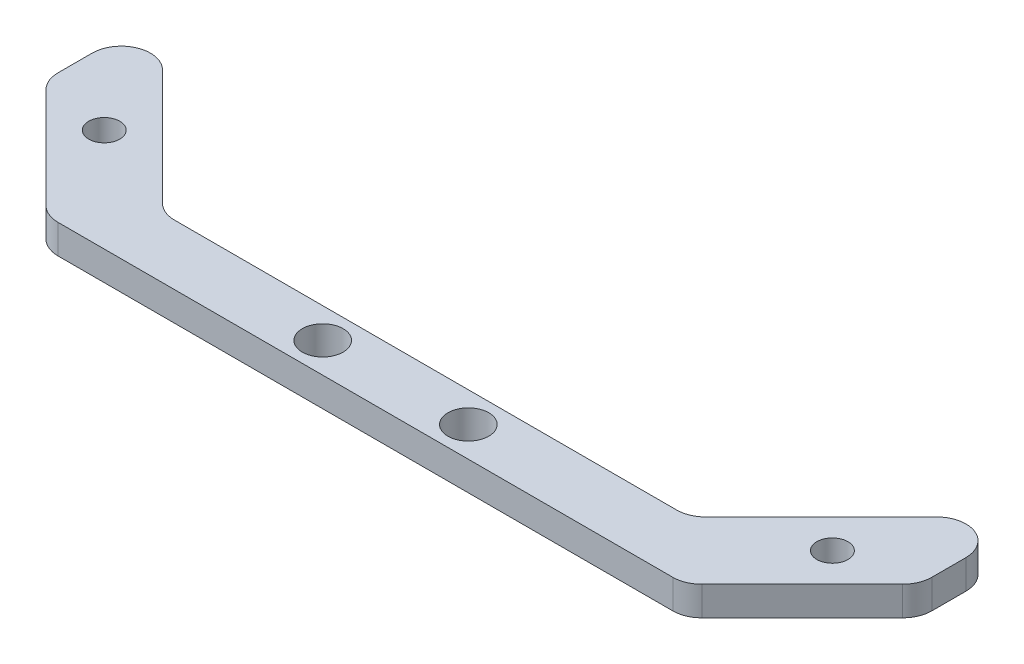
ISO-10303-21;
HEADER;
FILE_DESCRIPTION(('STEP AP214'),'2;1');
FILE_NAME('part.step','',(''),(''),'','','');
FILE_SCHEMA(('AUTOMOTIVE_DESIGN { 1 0 10303 214 1 1 1 1 }'));
ENDSEC;
DATA;
#1=APPLICATION_CONTEXT('core data for automotive mechanical design processes');
#2=APPLICATION_PROTOCOL_DEFINITION('international standard','automotive_design',2000,#1);
#3=PRODUCT_CONTEXT('',#1,'mechanical');
#4=PRODUCT('Part','Part','',(#3));
#5=PRODUCT_RELATED_PRODUCT_CATEGORY('part','',(#4));
#6=PRODUCT_DEFINITION_FORMATION('','',#4);
#7=PRODUCT_DEFINITION_CONTEXT('part definition',#1,'design');
#8=PRODUCT_DEFINITION('design','',#6,#7);
#9=PRODUCT_DEFINITION_SHAPE('','',#8);
#10=(LENGTH_UNIT() NAMED_UNIT(*) SI_UNIT(.MILLI.,.METRE.));
#11=(NAMED_UNIT(*) PLANE_ANGLE_UNIT() SI_UNIT($,.RADIAN.));
#12=(NAMED_UNIT(*) SI_UNIT($,.STERADIAN.) SOLID_ANGLE_UNIT());
#13=UNCERTAINTY_MEASURE_WITH_UNIT(LENGTH_MEASURE(1.E-05),#10,'distance_accuracy_value','');
#14=(GEOMETRIC_REPRESENTATION_CONTEXT(3) GLOBAL_UNCERTAINTY_ASSIGNED_CONTEXT((#13)) GLOBAL_UNIT_ASSIGNED_CONTEXT((#10,
#11,#12)) REPRESENTATION_CONTEXT('',''));
#15=CARTESIAN_POINT('',(0.,0.,0.));
#16=DIRECTION('',(0.,0.,1.));
#17=DIRECTION('',(1.,0.,0.));
#18=AXIS2_PLACEMENT_3D('',#15,#16,#17);
#19=CARTESIAN_POINT('',(0.,3.,0.));
#20=DIRECTION('',(0.,1.,0.));
#21=DIRECTION('',(0.,0.,1.));
#22=AXIS2_PLACEMENT_3D('',#19,#20,#21);
#23=PLANE('',#22);
#24=DIRECTION('',(-1.,0.,0.));
#25=VECTOR('',#24,1.);
#26=CARTESIAN_POINT('',(12.0999999999989,3.,12.0999999999989));
#27=LINE('',#26,#25);
#28=CARTESIAN_POINT('',(76.6573593128817,3.,12.0999999999989));
#29=VERTEX_POINT('',#28);
#30=CARTESIAN_POINT('',(13.3426406871183,3.,12.0999999999989));
#31=VERTEX_POINT('',#30);
#32=EDGE_CURVE('E193',#29,#31,#27,.T.);
#33=ORIENTED_EDGE('',*,*,#32,.F.);
#34=CARTESIAN_POINT('',(76.6573593128817,3.,9.09999999999893));
#35=DIRECTION('',(0.,1.,0.));
#36=DIRECTION('',(0.,0.,1.));
#37=AXIS2_PLACEMENT_3D('',#34,#35,#36);
#38=CIRCLE('',#37,3.);
#39=CARTESIAN_POINT('',(78.7786796564414,3.,11.2213203435586));
#40=VERTEX_POINT('',#39);
#41=EDGE_CURVE('E245',#29,#40,#38,.T.);
#42=ORIENTED_EDGE('',*,*,#41,.T.);
#43=DIRECTION('',(0.707106781186551,0.,-0.707106781186544));
#44=VECTOR('',#43,1.);
#45=CARTESIAN_POINT('',(75.,3.,14.9999999999999));
#46=LINE('',#45,#44);
#47=CARTESIAN_POINT('',(89.1213203435596,3.,0.878679656440435));
#48=VERTEX_POINT('',#47);
#49=EDGE_CURVE('E284',#40,#48,#46,.T.);
#50=ORIENTED_EDGE('',*,*,#49,.T.);
#51=CARTESIAN_POINT('',(87.,3.,-1.24264068711922));
#52=DIRECTION('',(0.,1.,0.));
#53=DIRECTION('',(0.,0.,1.));
#54=AXIS2_PLACEMENT_3D('',#51,#52,#53);
#55=CIRCLE('',#54,3.);
#56=CARTESIAN_POINT('',(90.,3.,-1.24264068711922));
#57=VERTEX_POINT('',#56);
#58=EDGE_CURVE('E296',#48,#57,#55,.T.);
#59=ORIENTED_EDGE('',*,*,#58,.T.);
#60=DIRECTION('',(0.,0.,-1.));
#61=VECTOR('',#60,1.);
#62=CARTESIAN_POINT('',(90.,3.,0.));
#63=LINE('',#62,#61);
#64=CARTESIAN_POINT('',(90.,3.,-4.75735931288078));
#65=VERTEX_POINT('',#64);
#66=EDGE_CURVE('E289',#57,#65,#63,.T.);
#67=ORIENTED_EDGE('',*,*,#66,.T.);
#68=CARTESIAN_POINT('',(87.,3.,-4.75735931288078));
#69=DIRECTION('',(0.,1.,0.));
#70=DIRECTION('',(0.,0.,1.));
#71=AXIS2_PLACEMENT_3D('',#68,#69,#70);
#72=CIRCLE('',#71,3.);
#73=CARTESIAN_POINT('',(84.8786796564403,3.,-6.87867965644042));
#74=VERTEX_POINT('',#73);
#75=EDGE_CURVE('E239',#65,#74,#72,.T.);
#76=ORIENTED_EDGE('',*,*,#75,.T.);
#77=DIRECTION('',(-0.707106781186547,0.,0.707106781186547));
#78=VECTOR('',#77,1.);
#79=CARTESIAN_POINT('',(75.,3.,2.99999999999992));
#80=LINE('',#79,#78);
#81=CARTESIAN_POINT('',(72.9786796564394,3.,5.02132034356055));
#82=VERTEX_POINT('',#81);
#83=EDGE_CURVE('E219',#74,#82,#80,.T.);
#84=ORIENTED_EDGE('',*,*,#83,.T.);
#85=CARTESIAN_POINT('',(70.8573593128797,3.,2.90000000000091));
#86=DIRECTION('',(0.,1.,0.));
#87=DIRECTION('',(0.,0.,1.));
#88=AXIS2_PLACEMENT_3D('',#85,#86,#87);
#89=CIRCLE('',#88,3.);
#90=CARTESIAN_POINT('',(70.8573593128797,3.,5.90000000000091));
#91=VERTEX_POINT('',#90);
#92=EDGE_CURVE('E57',#82,#91,#89,.F.);
#93=ORIENTED_EDGE('',*,*,#92,.T.);
#94=DIRECTION('',(1.,0.,0.));
#95=VECTOR('',#94,1.);
#96=CARTESIAN_POINT('',(17.900000000001,3.,5.90000000000091));
#97=LINE('',#96,#95);
#98=CARTESIAN_POINT('',(19.1426406871203,3.,5.90000000000091));
#99=VERTEX_POINT('',#98);
#100=EDGE_CURVE('E181',#99,#91,#97,.T.);
#101=ORIENTED_EDGE('',*,*,#100,.F.);
#102=CARTESIAN_POINT('',(19.1426406871203,3.,2.90000000000091));
#103=DIRECTION('',(0.,1.,0.));
#104=DIRECTION('',(0.,0.,1.));
#105=AXIS2_PLACEMENT_3D('',#102,#103,#104);
#106=CIRCLE('',#105,3.);
#107=CARTESIAN_POINT('',(17.0213203435607,3.,5.02132034356057));
#108=VERTEX_POINT('',#107);
#109=EDGE_CURVE('E163',#99,#108,#106,.F.);
#110=ORIENTED_EDGE('',*,*,#109,.T.);
#111=DIRECTION('',(-0.707106781186549,0.,-0.707106781186546));
#112=VECTOR('',#111,1.);
#113=CARTESIAN_POINT('',(0.,3.,-12.));
#114=LINE('',#113,#112);
#115=CARTESIAN_POINT('',(5.12132034355964,3.,-6.87867965644039));
#116=VERTEX_POINT('',#115);
#117=EDGE_CURVE('E214',#108,#116,#114,.T.);
#118=ORIENTED_EDGE('',*,*,#117,.T.);
#119=CARTESIAN_POINT('',(3.,3.,-4.75735931288074));
#120=DIRECTION('',(0.,1.,0.));
#121=DIRECTION('',(0.,0.,1.));
#122=AXIS2_PLACEMENT_3D('',#119,#120,#121);
#123=CIRCLE('',#122,3.);
#124=CARTESIAN_POINT('',(0.,3.,-4.75735931288074));
#125=VERTEX_POINT('',#124);
#126=EDGE_CURVE('E299',#116,#125,#123,.T.);
#127=ORIENTED_EDGE('',*,*,#126,.T.);
#128=DIRECTION('',(0.,0.,1.));
#129=VECTOR('',#128,1.);
#130=CARTESIAN_POINT('',(0.,3.,0.));
#131=LINE('',#130,#129);
#132=CARTESIAN_POINT('',(0.,3.,-1.24264068711929));
#133=VERTEX_POINT('',#132);
#134=EDGE_CURVE('E218',#125,#133,#131,.T.);
#135=ORIENTED_EDGE('',*,*,#134,.T.);
#136=CARTESIAN_POINT('',(3.,3.,-1.24264068711929));
#137=DIRECTION('',(0.,1.,0.));
#138=DIRECTION('',(0.,0.,1.));
#139=AXIS2_PLACEMENT_3D('',#136,#137,#138);
#140=CIRCLE('',#139,3.);
#141=CARTESIAN_POINT('',(0.878679656440363,3.,0.878679656440359));
#142=VERTEX_POINT('',#141);
#143=EDGE_CURVE('E233',#133,#142,#140,.T.);
#144=ORIENTED_EDGE('',*,*,#143,.T.);
#145=DIRECTION('',(0.707106781186549,0.,0.707106781186546));
#146=VECTOR('',#145,1.);
#147=CARTESIAN_POINT('',(0.,3.,0.));
#148=LINE('',#147,#146);
#149=CARTESIAN_POINT('',(11.2213203435586,3.,11.2213203435586));
#150=VERTEX_POINT('',#149);
#151=EDGE_CURVE('E279',#142,#150,#148,.T.);
#152=ORIENTED_EDGE('',*,*,#151,.T.);
#153=CARTESIAN_POINT('',(13.3426406871183,3.,9.09999999999893));
#154=DIRECTION('',(0.,1.,0.));
#155=DIRECTION('',(0.,0.,1.));
#156=AXIS2_PLACEMENT_3D('',#153,#154,#155);
#157=CIRCLE('',#156,3.);
#158=EDGE_CURVE('E238',#150,#31,#157,.T.);
#159=ORIENTED_EDGE('',*,*,#158,.T.);
#160=EDGE_LOOP('',(#33,#42,#50,#59,#67,#76,#84,#93,#101,#110,#118,#127,#135,#144,#152,#159));
#161=FACE_BOUND('',#160,.T.);
#162=CARTESIAN_POINT('',(82.5,3.,1.49999999999996));
#163=DIRECTION('',(0.,1.,0.));
#164=DIRECTION('',(0.,0.,-1.));
#165=AXIS2_PLACEMENT_3D('',#162,#163,#164);
#166=CIRCLE('',#165,1.60000000000001);
#167=CARTESIAN_POINT('',(82.5,3.,-0.100000000000044));
#168=VERTEX_POINT('',#167);
#169=EDGE_CURVE('E252',#168,#168,#166,.T.);
#170=ORIENTED_EDGE('',*,*,#169,.F.);
#171=EDGE_LOOP('',(#170));
#172=FACE_BOUND('',#171,.T.);
#173=CARTESIAN_POINT('',(7.5,3.,1.49999999999996));
#174=DIRECTION('',(0.,1.,0.));
#175=DIRECTION('',(0.,0.,1.));
#176=AXIS2_PLACEMENT_3D('',#173,#174,#175);
#177=CIRCLE('',#176,1.60000000000008);
#178=CARTESIAN_POINT('',(7.5,3.,3.10000000000004));
#179=VERTEX_POINT('',#178);
#180=EDGE_CURVE('E272',#179,#179,#177,.T.);
#181=ORIENTED_EDGE('',*,*,#180,.F.);
#182=EDGE_LOOP('',(#181));
#183=FACE_BOUND('',#182,.T.);
#184=CARTESIAN_POINT('',(37.5,3.,8.99999999999992));
#185=DIRECTION('',(0.,1.,0.));
#186=DIRECTION('',(0.,0.,1.));
#187=AXIS2_PLACEMENT_3D('',#184,#185,#186);
#188=CIRCLE('',#187,2.09999999999901);
#189=CARTESIAN_POINT('',(37.5,3.,11.0999999999989));
#190=VERTEX_POINT('',#189);
#191=EDGE_CURVE('E264',#190,#190,#188,.T.);
#192=ORIENTED_EDGE('',*,*,#191,.F.);
#193=EDGE_LOOP('',(#192));
#194=FACE_BOUND('',#193,.T.);
#195=CARTESIAN_POINT('',(52.5,3.,8.99999999999992));
#196=DIRECTION('',(0.,1.,0.));
#197=DIRECTION('',(0.,0.,-1.));
#198=AXIS2_PLACEMENT_3D('',#195,#196,#197);
#199=CIRCLE('',#198,2.09999999999901);
#200=CARTESIAN_POINT('',(52.5,3.,6.90000000000091));
#201=VERTEX_POINT('',#200);
#202=EDGE_CURVE('E263',#201,#201,#199,.T.);
#203=ORIENTED_EDGE('',*,*,#202,.F.);
#204=EDGE_LOOP('',(#203));
#205=FACE_BOUND('',#204,.T.);
#206=ADVANCED_FACE('F48',(#161,#172,#183,#194,#205),#23,.T.);
#207=CARTESIAN_POINT('',(0.,0.,0.));
#208=DIRECTION('',(0.,1.,0.));
#209=DIRECTION('',(0.,0.,1.));
#210=AXIS2_PLACEMENT_3D('',#207,#208,#209);
#211=PLANE('',#210);
#212=DIRECTION('',(0.707106781186551,0.,-0.707106781186544));
#213=VECTOR('',#212,1.);
#214=CARTESIAN_POINT('',(75.,0.,14.9999999999999));
#215=LINE('',#214,#213);
#216=CARTESIAN_POINT('',(78.7786796564414,0.,11.2213203435586));
#217=VERTEX_POINT('',#216);
#218=CARTESIAN_POINT('',(89.1213203435596,0.,0.878679656440435));
#219=VERTEX_POINT('',#218);
#220=EDGE_CURVE('E329',#217,#219,#215,.T.);
#221=ORIENTED_EDGE('',*,*,#220,.F.);
#222=CARTESIAN_POINT('',(76.6573593128817,0.,9.09999999999893));
#223=DIRECTION('',(0.,1.,0.));
#224=DIRECTION('',(0.,0.,1.));
#225=AXIS2_PLACEMENT_3D('',#222,#223,#224);
#226=CIRCLE('',#225,3.);
#227=CARTESIAN_POINT('',(76.6573593128817,0.,12.0999999999989));
#228=VERTEX_POINT('',#227);
#229=EDGE_CURVE('E395',#217,#228,#226,.F.);
#230=ORIENTED_EDGE('',*,*,#229,.T.);
#231=DIRECTION('',(-1.,0.,0.));
#232=VECTOR('',#231,1.);
#233=CARTESIAN_POINT('',(12.0999999999989,0.,12.0999999999989));
#234=LINE('',#233,#232);
#235=CARTESIAN_POINT('',(13.3426406871183,0.,12.0999999999989));
#236=VERTEX_POINT('',#235);
#237=EDGE_CURVE('E200',#228,#236,#234,.T.);
#238=ORIENTED_EDGE('',*,*,#237,.T.);
#239=CARTESIAN_POINT('',(13.3426406871183,0.,9.09999999999893));
#240=DIRECTION('',(0.,1.,0.));
#241=DIRECTION('',(0.,0.,1.));
#242=AXIS2_PLACEMENT_3D('',#239,#240,#241);
#243=CIRCLE('',#242,3.);
#244=CARTESIAN_POINT('',(11.2213203435586,0.,11.2213203435586));
#245=VERTEX_POINT('',#244);
#246=EDGE_CURVE('E350',#236,#245,#243,.F.);
#247=ORIENTED_EDGE('',*,*,#246,.T.);
#248=DIRECTION('',(0.707106781186549,0.,0.707106781186546));
#249=VECTOR('',#248,1.);
#250=CARTESIAN_POINT('',(0.,0.,0.));
#251=LINE('',#250,#249);
#252=CARTESIAN_POINT('',(0.878679656440363,0.,0.878679656440359));
#253=VERTEX_POINT('',#252);
#254=EDGE_CURVE('E226',#253,#245,#251,.T.);
#255=ORIENTED_EDGE('',*,*,#254,.F.);
#256=CARTESIAN_POINT('',(3.,0.,-1.24264068711929));
#257=DIRECTION('',(0.,1.,0.));
#258=DIRECTION('',(0.,0.,1.));
#259=AXIS2_PLACEMENT_3D('',#256,#257,#258);
#260=CIRCLE('',#259,3.);
#261=CARTESIAN_POINT('',(0.,0.,-1.24264068711929));
#262=VERTEX_POINT('',#261);
#263=EDGE_CURVE('E64',#253,#262,#260,.F.);
#264=ORIENTED_EDGE('',*,*,#263,.T.);
#265=DIRECTION('',(0.,0.,1.));
#266=VECTOR('',#265,1.);
#267=CARTESIAN_POINT('',(0.,0.,0.));
#268=LINE('',#267,#266);
#269=CARTESIAN_POINT('',(0.,0.,-4.75735931288074));
#270=VERTEX_POINT('',#269);
#271=EDGE_CURVE('E285',#270,#262,#268,.T.);
#272=ORIENTED_EDGE('',*,*,#271,.F.);
#273=CARTESIAN_POINT('',(3.,0.,-4.75735931288074));
#274=DIRECTION('',(0.,1.,0.));
#275=DIRECTION('',(0.,0.,1.));
#276=AXIS2_PLACEMENT_3D('',#273,#274,#275);
#277=CIRCLE('',#276,3.);
#278=CARTESIAN_POINT('',(5.12132034355964,0.,-6.87867965644039));
#279=VERTEX_POINT('',#278);
#280=EDGE_CURVE('E72',#270,#279,#277,.F.);
#281=ORIENTED_EDGE('',*,*,#280,.T.);
#282=DIRECTION('',(-0.707106781186549,0.,-0.707106781186546));
#283=VECTOR('',#282,1.);
#284=CARTESIAN_POINT('',(0.,0.,-12.));
#285=LINE('',#284,#283);
#286=CARTESIAN_POINT('',(17.0213203435607,0.,5.02132034356057));
#287=VERTEX_POINT('',#286);
#288=EDGE_CURVE('E318',#287,#279,#285,.T.);
#289=ORIENTED_EDGE('',*,*,#288,.F.);
#290=CARTESIAN_POINT('',(19.1426406871203,0.,2.90000000000091));
#291=DIRECTION('',(0.,1.,0.));
#292=DIRECTION('',(0.,0.,1.));
#293=AXIS2_PLACEMENT_3D('',#290,#291,#292);
#294=CIRCLE('',#293,3.);
#295=CARTESIAN_POINT('',(19.1426406871203,0.,5.90000000000091));
#296=VERTEX_POINT('',#295);
#297=EDGE_CURVE('E174',#287,#296,#294,.T.);
#298=ORIENTED_EDGE('',*,*,#297,.T.);
#299=DIRECTION('',(1.,0.,0.));
#300=VECTOR('',#299,1.);
#301=CARTESIAN_POINT('',(17.900000000001,0.,5.90000000000091));
#302=LINE('',#301,#300);
#303=CARTESIAN_POINT('',(70.8573593128797,0.,5.90000000000091));
#304=VERTEX_POINT('',#303);
#305=EDGE_CURVE('E184',#296,#304,#302,.T.);
#306=ORIENTED_EDGE('',*,*,#305,.T.);
#307=CARTESIAN_POINT('',(70.8573593128797,0.,2.90000000000091));
#308=DIRECTION('',(0.,1.,0.));
#309=DIRECTION('',(0.,0.,1.));
#310=AXIS2_PLACEMENT_3D('',#307,#308,#309);
#311=CIRCLE('',#310,3.);
#312=CARTESIAN_POINT('',(72.9786796564394,0.,5.02132034356055));
#313=VERTEX_POINT('',#312);
#314=EDGE_CURVE('E12',#304,#313,#311,.T.);
#315=ORIENTED_EDGE('',*,*,#314,.T.);
#316=DIRECTION('',(-0.707106781186547,0.,0.707106781186547));
#317=VECTOR('',#316,1.);
#318=CARTESIAN_POINT('',(75.,0.,2.99999999999992));
#319=LINE('',#318,#317);
#320=CARTESIAN_POINT('',(84.8786796564403,0.,-6.87867965644042));
#321=VERTEX_POINT('',#320);
#322=EDGE_CURVE('E322',#321,#313,#319,.T.);
#323=ORIENTED_EDGE('',*,*,#322,.F.);
#324=CARTESIAN_POINT('',(87.,0.,-4.75735931288078));
#325=DIRECTION('',(0.,1.,0.));
#326=DIRECTION('',(0.,0.,1.));
#327=AXIS2_PLACEMENT_3D('',#324,#325,#326);
#328=CIRCLE('',#327,3.);
#329=CARTESIAN_POINT('',(90.,0.,-4.75735931288078));
#330=VERTEX_POINT('',#329);
#331=EDGE_CURVE('E409',#321,#330,#328,.F.);
#332=ORIENTED_EDGE('',*,*,#331,.T.);
#333=DIRECTION('',(0.,0.,-1.));
#334=VECTOR('',#333,1.);
#335=CARTESIAN_POINT('',(90.,0.,0.));
#336=LINE('',#335,#334);
#337=CARTESIAN_POINT('',(90.,0.,-1.24264068711922));
#338=VERTEX_POINT('',#337);
#339=EDGE_CURVE('E326',#338,#330,#336,.T.);
#340=ORIENTED_EDGE('',*,*,#339,.F.);
#341=CARTESIAN_POINT('',(87.,0.,-1.24264068711922));
#342=DIRECTION('',(0.,1.,0.));
#343=DIRECTION('',(0.,0.,1.));
#344=AXIS2_PLACEMENT_3D('',#341,#342,#343);
#345=CIRCLE('',#344,3.);
#346=EDGE_CURVE('E406',#338,#219,#345,.F.);
#347=ORIENTED_EDGE('',*,*,#346,.T.);
#348=EDGE_LOOP('',(#221,#230,#238,#247,#255,#264,#272,#281,#289,#298,#306,#315,#323,#332,#340,#347));
#349=FACE_BOUND('',#348,.T.);
#350=CARTESIAN_POINT('',(7.5,0.,1.49999999999996));
#351=DIRECTION('',(0.,1.,0.));
#352=DIRECTION('',(0.,0.,1.));
#353=AXIS2_PLACEMENT_3D('',#350,#351,#352);
#354=CIRCLE('',#353,1.60000000000008);
#355=CARTESIAN_POINT('',(7.5,0.,3.10000000000004));
#356=VERTEX_POINT('',#355);
#357=EDGE_CURVE('E269',#356,#356,#354,.T.);
#358=ORIENTED_EDGE('',*,*,#357,.T.);
#359=EDGE_LOOP('',(#358));
#360=FACE_BOUND('',#359,.T.);
#361=CARTESIAN_POINT('',(37.5,0.,8.99999999999992));
#362=DIRECTION('',(0.,1.,0.));
#363=DIRECTION('',(0.,0.,1.));
#364=AXIS2_PLACEMENT_3D('',#361,#362,#363);
#365=CIRCLE('',#364,2.09999999999901);
#366=CARTESIAN_POINT('',(37.5,0.,11.0999999999989));
#367=VERTEX_POINT('',#366);
#368=EDGE_CURVE('E258',#367,#367,#365,.T.);
#369=ORIENTED_EDGE('',*,*,#368,.T.);
#370=EDGE_LOOP('',(#369));
#371=FACE_BOUND('',#370,.T.);
#372=CARTESIAN_POINT('',(82.5,0.,1.49999999999996));
#373=DIRECTION('',(0.,1.,0.));
#374=DIRECTION('',(0.,0.,-1.));
#375=AXIS2_PLACEMENT_3D('',#372,#373,#374);
#376=CIRCLE('',#375,1.60000000000001);
#377=CARTESIAN_POINT('',(82.5,0.,-0.100000000000044));
#378=VERTEX_POINT('',#377);
#379=EDGE_CURVE('E259',#378,#378,#376,.T.);
#380=ORIENTED_EDGE('',*,*,#379,.T.);
#381=EDGE_LOOP('',(#380));
#382=FACE_BOUND('',#381,.T.);
#383=CARTESIAN_POINT('',(52.5,0.,8.99999999999992));
#384=DIRECTION('',(0.,1.,0.));
#385=DIRECTION('',(0.,0.,-1.));
#386=AXIS2_PLACEMENT_3D('',#383,#384,#385);
#387=CIRCLE('',#386,2.09999999999901);
#388=CARTESIAN_POINT('',(52.5,0.,6.90000000000091));
#389=VERTEX_POINT('',#388);
#390=EDGE_CURVE('E197',#389,#389,#387,.T.);
#391=ORIENTED_EDGE('',*,*,#390,.T.);
#392=EDGE_LOOP('',(#391));
#393=FACE_BOUND('',#392,.T.);
#394=ADVANCED_FACE('F373',(#349,#360,#371,#382,#393),#211,.F.);
#395=CARTESIAN_POINT('',(0.,3.,0.));
#396=DIRECTION('',(0.707106781186546,0.,-0.707106781186549));
#397=DIRECTION('',(-0.707106781186549,0.,-0.707106781186546));
#398=AXIS2_PLACEMENT_3D('',#395,#396,#397);
#399=PLANE('',#398);
#400=ORIENTED_EDGE('',*,*,#254,.T.);
#401=DIRECTION('',(0.,1.,0.));
#402=VECTOR('',#401,1.);
#403=CARTESIAN_POINT('',(11.2213203435586,3.,11.2213203435586));
#404=LINE('',#403,#402);
#405=EDGE_CURVE('E343',#245,#150,#404,.T.);
#406=ORIENTED_EDGE('',*,*,#405,.T.);
#407=ORIENTED_EDGE('',*,*,#151,.F.);
#408=DIRECTION('',(0.,-1.,0.));
#409=VECTOR('',#408,1.);
#410=CARTESIAN_POINT('',(0.878679656440363,3.,0.878679656440358));
#411=LINE('',#410,#409);
#412=EDGE_CURVE('E345',#142,#253,#411,.T.);
#413=ORIENTED_EDGE('',*,*,#412,.T.);
#414=EDGE_LOOP('',(#400,#406,#407,#413));
#415=FACE_BOUND('',#414,.T.);
#416=ADVANCED_FACE('F341',(#415),#399,.F.);
#417=CARTESIAN_POINT('',(75.,3.,14.9999999999999));
#418=DIRECTION('',(-0.707106781186544,0.,-0.707106781186551));
#419=DIRECTION('',(-0.707106781186551,0.,0.707106781186544));
#420=AXIS2_PLACEMENT_3D('',#417,#418,#419);
#421=PLANE('',#420);
#422=ORIENTED_EDGE('',*,*,#49,.F.);
#423=DIRECTION('',(0.,1.,0.));
#424=VECTOR('',#423,1.);
#425=CARTESIAN_POINT('',(78.7786796564414,3.,11.2213203435586));
#426=LINE('',#425,#424);
#427=EDGE_CURVE('E396',#40,#217,#426,.F.);
#428=ORIENTED_EDGE('',*,*,#427,.T.);
#429=ORIENTED_EDGE('',*,*,#220,.T.);
#430=DIRECTION('',(0.,-1.,0.));
#431=VECTOR('',#430,1.);
#432=CARTESIAN_POINT('',(89.1213203435596,3.,0.878679656440435));
#433=LINE('',#432,#431);
#434=EDGE_CURVE('E399',#219,#48,#433,.F.);
#435=ORIENTED_EDGE('',*,*,#434,.T.);
#436=EDGE_LOOP('',(#422,#428,#429,#435));
#437=FACE_BOUND('',#436,.T.);
#438=ADVANCED_FACE('F472',(#437),#421,.F.);
#439=CARTESIAN_POINT('',(90.,3.,0.));
#440=DIRECTION('',(-1.,0.,0.));
#441=DIRECTION('',(0.,0.,1.));
#442=AXIS2_PLACEMENT_3D('',#439,#440,#441);
#443=PLANE('',#442);
#444=ORIENTED_EDGE('',*,*,#339,.T.);
#445=DIRECTION('',(0.,-1.,0.));
#446=VECTOR('',#445,1.);
#447=CARTESIAN_POINT('',(90.,3.,-4.75735931288078));
#448=LINE('',#447,#446);
#449=EDGE_CURVE('E175',#330,#65,#448,.F.);
#450=ORIENTED_EDGE('',*,*,#449,.T.);
#451=ORIENTED_EDGE('',*,*,#66,.F.);
#452=DIRECTION('',(0.,-1.,0.));
#453=VECTOR('',#452,1.);
#454=CARTESIAN_POINT('',(90.,3.,-1.24264068711922));
#455=LINE('',#454,#453);
#456=EDGE_CURVE('E364',#57,#338,#455,.T.);
#457=ORIENTED_EDGE('',*,*,#456,.T.);
#458=EDGE_LOOP('',(#444,#450,#451,#457));
#459=FACE_BOUND('',#458,.T.);
#460=ADVANCED_FACE('F469',(#459),#443,.F.);
#461=CARTESIAN_POINT('',(75.,3.,2.99999999999992));
#462=DIRECTION('',(0.707106781186548,0.,0.707106781186548));
#463=DIRECTION('',(0.707106781186548,0.,-0.707106781186548));
#464=AXIS2_PLACEMENT_3D('',#461,#462,#463);
#465=PLANE('',#464);
#466=ORIENTED_EDGE('',*,*,#322,.T.);
#467=DIRECTION('',(0.,1.,0.));
#468=VECTOR('',#467,1.);
#469=CARTESIAN_POINT('',(72.9786796564394,3.,5.02132034356055));
#470=LINE('',#469,#468);
#471=EDGE_CURVE('E358',#313,#82,#470,.T.);
#472=ORIENTED_EDGE('',*,*,#471,.T.);
#473=ORIENTED_EDGE('',*,*,#83,.F.);
#474=DIRECTION('',(0.,-1.,0.));
#475=VECTOR('',#474,1.);
#476=CARTESIAN_POINT('',(84.8786796564403,3.,-6.87867965644043));
#477=LINE('',#476,#475);
#478=EDGE_CURVE('E418',#74,#321,#477,.T.);
#479=ORIENTED_EDGE('',*,*,#478,.T.);
#480=EDGE_LOOP('',(#466,#472,#473,#479));
#481=FACE_BOUND('',#480,.T.);
#482=ADVANCED_FACE('F426',(#481),#465,.F.);
#483=CARTESIAN_POINT('',(0.,3.,-12.));
#484=DIRECTION('',(-0.707106781186546,0.,0.707106781186549));
#485=DIRECTION('',(0.707106781186549,0.,0.707106781186546));
#486=AXIS2_PLACEMENT_3D('',#483,#484,#485);
#487=PLANE('',#486);
#488=ORIENTED_EDGE('',*,*,#117,.F.);
#489=DIRECTION('',(0.,1.,0.));
#490=VECTOR('',#489,1.);
#491=CARTESIAN_POINT('',(17.0213203435607,0.,5.02132034356056));
#492=LINE('',#491,#490);
#493=EDGE_CURVE('E168',#108,#287,#492,.F.);
#494=ORIENTED_EDGE('',*,*,#493,.T.);
#495=ORIENTED_EDGE('',*,*,#288,.T.);
#496=DIRECTION('',(0.,-1.,0.));
#497=VECTOR('',#496,1.);
#498=CARTESIAN_POINT('',(5.12132034355964,3.,-6.87867965644039));
#499=LINE('',#498,#497);
#500=EDGE_CURVE('E186',#279,#116,#499,.F.);
#501=ORIENTED_EDGE('',*,*,#500,.T.);
#502=EDGE_LOOP('',(#488,#494,#495,#501));
#503=FACE_BOUND('',#502,.T.);
#504=ADVANCED_FACE('F377',(#503),#487,.F.);
#505=CARTESIAN_POINT('',(0.,3.,0.));
#506=DIRECTION('',(1.,0.,0.));
#507=DIRECTION('',(0.,0.,-1.));
#508=AXIS2_PLACEMENT_3D('',#505,#506,#507);
#509=PLANE('',#508);
#510=ORIENTED_EDGE('',*,*,#271,.T.);
#511=DIRECTION('',(0.,-1.,0.));
#512=VECTOR('',#511,1.);
#513=CARTESIAN_POINT('',(0.,3.,-1.24264068711929));
#514=LINE('',#513,#512);
#515=EDGE_CURVE('E356',#262,#133,#514,.F.);
#516=ORIENTED_EDGE('',*,*,#515,.T.);
#517=ORIENTED_EDGE('',*,*,#134,.F.);
#518=DIRECTION('',(0.,-1.,0.));
#519=VECTOR('',#518,1.);
#520=CARTESIAN_POINT('',(0.,3.,-4.75735931288074));
#521=LINE('',#520,#519);
#522=EDGE_CURVE('E352',#125,#270,#521,.T.);
#523=ORIENTED_EDGE('',*,*,#522,.T.);
#524=EDGE_LOOP('',(#510,#516,#517,#523));
#525=FACE_BOUND('',#524,.T.);
#526=ADVANCED_FACE('F382',(#525),#509,.F.);
#527=CARTESIAN_POINT('',(7.5,3.,1.49999999999996));
#528=DIRECTION('',(0.,-1.,0.));
#529=DIRECTION('',(0.,0.,-1.));
#530=AXIS2_PLACEMENT_3D('',#527,#528,#529);
#531=CYLINDRICAL_SURFACE('',#530,1.60000000000008);
#532=ORIENTED_EDGE('',*,*,#180,.T.);
#533=EDGE_LOOP('',(#532));
#534=FACE_BOUND('',#533,.T.);
#535=ORIENTED_EDGE('',*,*,#357,.F.);
#536=EDGE_LOOP('',(#535));
#537=FACE_BOUND('',#536,.T.);
#538=ADVANCED_FACE('F460',(#534,#537),#531,.F.);
#539=CARTESIAN_POINT('',(37.5,3.,8.99999999999992));
#540=DIRECTION('',(0.,-1.,0.));
#541=DIRECTION('',(0.,0.,-1.));
#542=AXIS2_PLACEMENT_3D('',#539,#540,#541);
#543=CYLINDRICAL_SURFACE('',#542,2.09999999999901);
#544=ORIENTED_EDGE('',*,*,#191,.T.);
#545=EDGE_LOOP('',(#544));
#546=FACE_BOUND('',#545,.T.);
#547=ORIENTED_EDGE('',*,*,#368,.F.);
#548=EDGE_LOOP('',(#547));
#549=FACE_BOUND('',#548,.T.);
#550=ADVANCED_FACE('F492',(#546,#549),#543,.F.);
#551=CARTESIAN_POINT('',(82.5,3.,1.49999999999996));
#552=DIRECTION('',(0.,-1.,0.));
#553=DIRECTION('',(0.,0.,-1.));
#554=AXIS2_PLACEMENT_3D('',#551,#552,#553);
#555=CYLINDRICAL_SURFACE('',#554,1.60000000000001);
#556=ORIENTED_EDGE('',*,*,#169,.T.);
#557=EDGE_LOOP('',(#556));
#558=FACE_BOUND('',#557,.T.);
#559=ORIENTED_EDGE('',*,*,#379,.F.);
#560=EDGE_LOOP('',(#559));
#561=FACE_BOUND('',#560,.T.);
#562=ADVANCED_FACE('F489',(#558,#561),#555,.F.);
#563=CARTESIAN_POINT('',(52.5,3.,8.99999999999992));
#564=DIRECTION('',(0.,-1.,0.));
#565=DIRECTION('',(0.,0.,-1.));
#566=AXIS2_PLACEMENT_3D('',#563,#564,#565);
#567=CYLINDRICAL_SURFACE('',#566,2.09999999999901);
#568=ORIENTED_EDGE('',*,*,#202,.T.);
#569=EDGE_LOOP('',(#568));
#570=FACE_BOUND('',#569,.T.);
#571=ORIENTED_EDGE('',*,*,#390,.F.);
#572=EDGE_LOOP('',(#571));
#573=FACE_BOUND('',#572,.T.);
#574=ADVANCED_FACE('F485',(#570,#573),#567,.F.);
#575=CARTESIAN_POINT('',(17.900000000001,0.,5.90000000000091));
#576=DIRECTION('',(0.,0.,1.));
#577=DIRECTION('',(1.,0.,0.));
#578=AXIS2_PLACEMENT_3D('',#575,#576,#577);
#579=PLANE('',#578);
#580=ORIENTED_EDGE('',*,*,#305,.F.);
#581=DIRECTION('',(0.,1.,0.));
#582=VECTOR('',#581,1.);
#583=CARTESIAN_POINT('',(19.1426406871203,3.,5.90000000000091));
#584=LINE('',#583,#582);
#585=EDGE_CURVE('E167',#296,#99,#584,.T.);
#586=ORIENTED_EDGE('',*,*,#585,.T.);
#587=ORIENTED_EDGE('',*,*,#100,.T.);
#588=DIRECTION('',(0.,1.,0.));
#589=VECTOR('',#588,1.);
#590=CARTESIAN_POINT('',(70.8573593128797,0.,5.90000000000091));
#591=LINE('',#590,#589);
#592=EDGE_CURVE('E187',#91,#304,#591,.F.);
#593=ORIENTED_EDGE('',*,*,#592,.T.);
#594=EDGE_LOOP('',(#580,#586,#587,#593));
#595=FACE_BOUND('',#594,.T.);
#596=ADVANCED_FACE('F180',(#595),#579,.F.);
#597=CARTESIAN_POINT('',(12.0999999999989,0.,12.0999999999989));
#598=DIRECTION('',(0.,0.,-1.));
#599=DIRECTION('',(-1.,0.,0.));
#600=AXIS2_PLACEMENT_3D('',#597,#598,#599);
#601=PLANE('',#600);
#602=ORIENTED_EDGE('',*,*,#237,.F.);
#603=DIRECTION('',(0.,1.,0.));
#604=VECTOR('',#603,1.);
#605=CARTESIAN_POINT('',(76.6573593128817,0.,12.0999999999989));
#606=LINE('',#605,#604);
#607=EDGE_CURVE('E303',#228,#29,#606,.T.);
#608=ORIENTED_EDGE('',*,*,#607,.T.);
#609=ORIENTED_EDGE('',*,*,#32,.T.);
#610=DIRECTION('',(0.,1.,0.));
#611=VECTOR('',#610,1.);
#612=CARTESIAN_POINT('',(13.3426406871183,0.,12.0999999999989));
#613=LINE('',#612,#611);
#614=EDGE_CURVE('E307',#31,#236,#613,.F.);
#615=ORIENTED_EDGE('',*,*,#614,.T.);
#616=EDGE_LOOP('',(#602,#608,#609,#615));
#617=FACE_BOUND('',#616,.T.);
#618=ADVANCED_FACE('F388',(#617),#601,.F.);
#619=CARTESIAN_POINT('',(19.1426406871203,0.,2.90000000000091));
#620=DIRECTION('',(0.,-1.,0.));
#621=DIRECTION('',(0.,0.,-1.));
#622=AXIS2_PLACEMENT_3D('',#619,#620,#621);
#623=CYLINDRICAL_SURFACE('',#622,3.);
#624=ORIENTED_EDGE('',*,*,#297,.F.);
#625=ORIENTED_EDGE('',*,*,#493,.F.);
#626=ORIENTED_EDGE('',*,*,#109,.F.);
#627=ORIENTED_EDGE('',*,*,#585,.F.);
#628=EDGE_LOOP('',(#624,#625,#626,#627));
#629=FACE_BOUND('',#628,.T.);
#630=ADVANCED_FACE('F166',(#629),#623,.F.);
#631=CARTESIAN_POINT('',(76.6573593128817,0.,9.09999999999893));
#632=DIRECTION('',(0.,1.,0.));
#633=DIRECTION('',(0.,0.,1.));
#634=AXIS2_PLACEMENT_3D('',#631,#632,#633);
#635=CYLINDRICAL_SURFACE('',#634,3.);
#636=ORIENTED_EDGE('',*,*,#229,.F.);
#637=ORIENTED_EDGE('',*,*,#427,.F.);
#638=ORIENTED_EDGE('',*,*,#41,.F.);
#639=ORIENTED_EDGE('',*,*,#607,.F.);
#640=EDGE_LOOP('',(#636,#637,#638,#639));
#641=FACE_BOUND('',#640,.T.);
#642=ADVANCED_FACE('F393',(#641),#635,.T.);
#643=CARTESIAN_POINT('',(70.8573593128797,3.,2.90000000000091));
#644=DIRECTION('',(0.,-1.,0.));
#645=DIRECTION('',(0.,0.,-1.));
#646=AXIS2_PLACEMENT_3D('',#643,#644,#645);
#647=CYLINDRICAL_SURFACE('',#646,3.);
#648=ORIENTED_EDGE('',*,*,#314,.F.);
#649=ORIENTED_EDGE('',*,*,#592,.F.);
#650=ORIENTED_EDGE('',*,*,#92,.F.);
#651=ORIENTED_EDGE('',*,*,#471,.F.);
#652=EDGE_LOOP('',(#648,#649,#650,#651));
#653=FACE_BOUND('',#652,.T.);
#654=ADVANCED_FACE('F443',(#653),#647,.F.);
#655=CARTESIAN_POINT('',(13.3426406871183,3.,9.09999999999893));
#656=DIRECTION('',(0.,1.,0.));
#657=DIRECTION('',(0.,0.,1.));
#658=AXIS2_PLACEMENT_3D('',#655,#656,#657);
#659=CYLINDRICAL_SURFACE('',#658,3.);
#660=ORIENTED_EDGE('',*,*,#246,.F.);
#661=ORIENTED_EDGE('',*,*,#614,.F.);
#662=ORIENTED_EDGE('',*,*,#158,.F.);
#663=ORIENTED_EDGE('',*,*,#405,.F.);
#664=EDGE_LOOP('',(#660,#661,#662,#663));
#665=FACE_BOUND('',#664,.T.);
#666=ADVANCED_FACE('F348',(#665),#659,.T.);
#667=CARTESIAN_POINT('',(3.,3.,-1.24264068711929));
#668=DIRECTION('',(0.,-1.,0.));
#669=DIRECTION('',(0.,0.,-1.));
#670=AXIS2_PLACEMENT_3D('',#667,#668,#669);
#671=CYLINDRICAL_SURFACE('',#670,3.);
#672=ORIENTED_EDGE('',*,*,#143,.F.);
#673=ORIENTED_EDGE('',*,*,#515,.F.);
#674=ORIENTED_EDGE('',*,*,#263,.F.);
#675=ORIENTED_EDGE('',*,*,#412,.F.);
#676=EDGE_LOOP('',(#672,#673,#674,#675));
#677=FACE_BOUND('',#676,.T.);
#678=ADVANCED_FACE('F385',(#677),#671,.T.);
#679=CARTESIAN_POINT('',(87.,3.,-4.75735931288078));
#680=DIRECTION('',(0.,-1.,0.));
#681=DIRECTION('',(0.,0.,-1.));
#682=AXIS2_PLACEMENT_3D('',#679,#680,#681);
#683=CYLINDRICAL_SURFACE('',#682,3.);
#684=ORIENTED_EDGE('',*,*,#75,.F.);
#685=ORIENTED_EDGE('',*,*,#449,.F.);
#686=ORIENTED_EDGE('',*,*,#331,.F.);
#687=ORIENTED_EDGE('',*,*,#478,.F.);
#688=EDGE_LOOP('',(#684,#685,#686,#687));
#689=FACE_BOUND('',#688,.T.);
#690=ADVANCED_FACE('F440',(#689),#683,.T.);
#691=CARTESIAN_POINT('',(87.,3.,-1.24264068711922));
#692=DIRECTION('',(0.,-1.,0.));
#693=DIRECTION('',(0.,0.,-1.));
#694=AXIS2_PLACEMENT_3D('',#691,#692,#693);
#695=CYLINDRICAL_SURFACE('',#694,3.);
#696=ORIENTED_EDGE('',*,*,#58,.F.);
#697=ORIENTED_EDGE('',*,*,#434,.F.);
#698=ORIENTED_EDGE('',*,*,#346,.F.);
#699=ORIENTED_EDGE('',*,*,#456,.F.);
#700=EDGE_LOOP('',(#696,#697,#698,#699));
#701=FACE_BOUND('',#700,.T.);
#702=ADVANCED_FACE('F517',(#701),#695,.T.);
#703=CARTESIAN_POINT('',(3.,3.,-4.75735931288074));
#704=DIRECTION('',(0.,-1.,0.));
#705=DIRECTION('',(0.,0.,-1.));
#706=AXIS2_PLACEMENT_3D('',#703,#704,#705);
#707=CYLINDRICAL_SURFACE('',#706,3.);
#708=ORIENTED_EDGE('',*,*,#126,.F.);
#709=ORIENTED_EDGE('',*,*,#500,.F.);
#710=ORIENTED_EDGE('',*,*,#280,.F.);
#711=ORIENTED_EDGE('',*,*,#522,.F.);
#712=EDGE_LOOP('',(#708,#709,#710,#711));
#713=FACE_BOUND('',#712,.T.);
#714=ADVANCED_FACE('F50',(#713),#707,.T.);
#715=CLOSED_SHELL('',(#206,#394,#416,#438,#460,#482,#504,#526,#538,#550,#562,#574,#596,#618,
#630,#642,#654,#666,#678,#690,#702,#714));
#716=MANIFOLD_SOLID_BREP('B2',#715);
#717=ADVANCED_BREP_SHAPE_REPRESENTATION('',(#18,#716),#14);
#718=SHAPE_DEFINITION_REPRESENTATION(#9,#717);
ENDSEC;
END-ISO-10303-21;
